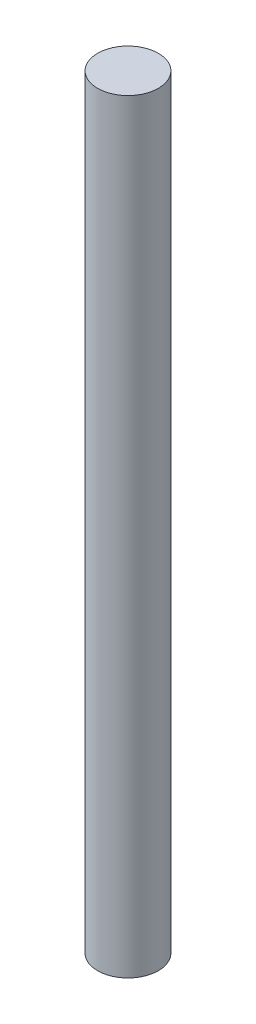
ISO-10303-21;
HEADER;
FILE_DESCRIPTION(('STEP AP214'),'2;1');
FILE_NAME('part.step','',(''),(''),'','','');
FILE_SCHEMA(('AUTOMOTIVE_DESIGN { 1 0 10303 214 1 1 1 1 }'));
ENDSEC;
DATA;
#1=APPLICATION_CONTEXT('core data for automotive mechanical design processes');
#2=APPLICATION_PROTOCOL_DEFINITION('international standard','automotive_design',2000,#1);
#3=PRODUCT_CONTEXT('',#1,'mechanical');
#4=PRODUCT('Part','Part','',(#3));
#5=PRODUCT_RELATED_PRODUCT_CATEGORY('part','',(#4));
#6=PRODUCT_DEFINITION_FORMATION('','',#4);
#7=PRODUCT_DEFINITION_CONTEXT('part definition',#1,'design');
#8=PRODUCT_DEFINITION('design','',#6,#7);
#9=PRODUCT_DEFINITION_SHAPE('','',#8);
#10=(LENGTH_UNIT() NAMED_UNIT(*) SI_UNIT(.MILLI.,.METRE.));
#11=(NAMED_UNIT(*) PLANE_ANGLE_UNIT() SI_UNIT($,.RADIAN.));
#12=(NAMED_UNIT(*) SI_UNIT($,.STERADIAN.) SOLID_ANGLE_UNIT());
#13=UNCERTAINTY_MEASURE_WITH_UNIT(LENGTH_MEASURE(1.E-05),#10,'distance_accuracy_value','');
#14=(GEOMETRIC_REPRESENTATION_CONTEXT(3) GLOBAL_UNCERTAINTY_ASSIGNED_CONTEXT((#13)) GLOBAL_UNIT_ASSIGNED_CONTEXT((#10,
#11,#12)) REPRESENTATION_CONTEXT('',''));
#15=CARTESIAN_POINT('',(0.,0.,0.));
#16=DIRECTION('',(0.,0.,1.));
#17=DIRECTION('',(1.,0.,0.));
#18=AXIS2_PLACEMENT_3D('',#15,#16,#17);
#19=CARTESIAN_POINT('',(0.,19.177,0.));
#20=DIRECTION('',(0.,-1.,0.));
#21=DIRECTION('',(0.,0.,-1.));
#22=AXIS2_PLACEMENT_3D('',#19,#20,#21);
#23=CYLINDRICAL_SURFACE('',#22,0.762);
#24=CARTESIAN_POINT('',(0.,19.177,0.));
#25=DIRECTION('',(0.,1.,0.));
#26=DIRECTION('',(0.,0.,1.));
#27=AXIS2_PLACEMENT_3D('',#24,#25,#26);
#28=CIRCLE('',#27,0.762);
#29=CARTESIAN_POINT('',(0.,19.177,0.762));
#30=VERTEX_POINT('',#29);
#31=EDGE_CURVE('E10',#30,#30,#28,.T.);
#32=ORIENTED_EDGE('',*,*,#31,.F.);
#33=EDGE_LOOP('',(#32));
#34=FACE_BOUND('',#33,.T.);
#35=CARTESIAN_POINT('',(0.,0.,0.));
#36=DIRECTION('',(0.,1.,0.));
#37=DIRECTION('',(0.,0.,1.));
#38=AXIS2_PLACEMENT_3D('',#35,#36,#37);
#39=CIRCLE('',#38,0.762);
#40=CARTESIAN_POINT('',(0.,0.,0.762));
#41=VERTEX_POINT('',#40);
#42=EDGE_CURVE('E36',#41,#41,#39,.T.);
#43=ORIENTED_EDGE('',*,*,#42,.T.);
#44=EDGE_LOOP('',(#43));
#45=FACE_BOUND('',#44,.T.);
#46=ADVANCED_FACE('F33',(#34,#45),#23,.T.);
#47=CARTESIAN_POINT('',(0.,19.177,0.));
#48=DIRECTION('',(0.,1.,0.));
#49=DIRECTION('',(0.,0.,1.));
#50=AXIS2_PLACEMENT_3D('',#47,#48,#49);
#51=PLANE('',#50);
#52=ORIENTED_EDGE('',*,*,#31,.T.);
#53=EDGE_LOOP('',(#52));
#54=FACE_BOUND('',#53,.T.);
#55=ADVANCED_FACE('F48',(#54),#51,.T.);
#56=CARTESIAN_POINT('',(0.,0.,0.));
#57=DIRECTION('',(0.,1.,0.));
#58=DIRECTION('',(0.,0.,1.));
#59=AXIS2_PLACEMENT_3D('',#56,#57,#58);
#60=PLANE('',#59);
#61=ORIENTED_EDGE('',*,*,#42,.F.);
#62=EDGE_LOOP('',(#61));
#63=FACE_BOUND('',#62,.T.);
#64=ADVANCED_FACE('F46',(#63),#60,.F.);
#65=CLOSED_SHELL('',(#46,#55,#64));
#66=MANIFOLD_SOLID_BREP('B2',#65);
#67=ADVANCED_BREP_SHAPE_REPRESENTATION('',(#18,#66),#14);
#68=SHAPE_DEFINITION_REPRESENTATION(#9,#67);
ENDSEC;
END-ISO-10303-21;
